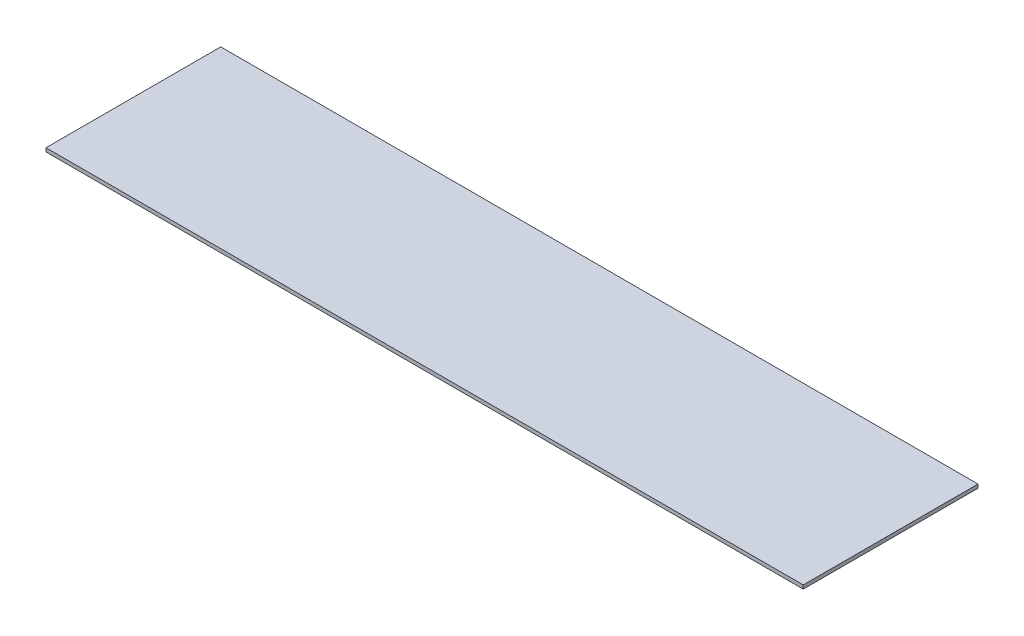
ISO-10303-21;
HEADER;
FILE_DESCRIPTION(('STEP AP214'),'2;1');
FILE_NAME('part.step','',(''),(''),'','','');
FILE_SCHEMA(('AUTOMOTIVE_DESIGN { 1 0 10303 214 1 1 1 1 }'));
ENDSEC;
DATA;
#1=APPLICATION_CONTEXT('core data for automotive mechanical design processes');
#2=APPLICATION_PROTOCOL_DEFINITION('international standard','automotive_design',2000,#1);
#3=PRODUCT_CONTEXT('',#1,'mechanical');
#4=PRODUCT('Part','Part','',(#3));
#5=PRODUCT_RELATED_PRODUCT_CATEGORY('part','',(#4));
#6=PRODUCT_DEFINITION_FORMATION('','',#4);
#7=PRODUCT_DEFINITION_CONTEXT('part definition',#1,'design');
#8=PRODUCT_DEFINITION('design','',#6,#7);
#9=PRODUCT_DEFINITION_SHAPE('','',#8);
#10=(LENGTH_UNIT() NAMED_UNIT(*) SI_UNIT(.MILLI.,.METRE.));
#11=(NAMED_UNIT(*) PLANE_ANGLE_UNIT() SI_UNIT($,.RADIAN.));
#12=(NAMED_UNIT(*) SI_UNIT($,.STERADIAN.) SOLID_ANGLE_UNIT());
#13=UNCERTAINTY_MEASURE_WITH_UNIT(LENGTH_MEASURE(1.E-05),#10,'distance_accuracy_value','');
#14=(GEOMETRIC_REPRESENTATION_CONTEXT(3) GLOBAL_UNCERTAINTY_ASSIGNED_CONTEXT((#13)) GLOBAL_UNIT_ASSIGNED_CONTEXT((#10,
#11,#12)) REPRESENTATION_CONTEXT('',''));
#15=CARTESIAN_POINT('',(0.,0.,0.));
#16=DIRECTION('',(0.,0.,1.));
#17=DIRECTION('',(1.,0.,0.));
#18=AXIS2_PLACEMENT_3D('',#15,#16,#17);
#19=CARTESIAN_POINT('',(208.,2.,-48.));
#20=DIRECTION('',(-1.,0.,0.));
#21=DIRECTION('',(0.,0.,1.));
#22=AXIS2_PLACEMENT_3D('',#19,#20,#21);
#23=PLANE('',#22);
#24=DIRECTION('',(0.,0.,-1.));
#25=VECTOR('',#24,1.);
#26=CARTESIAN_POINT('',(208.,0.,-48.));
#27=LINE('',#26,#25);
#28=CARTESIAN_POINT('',(208.,0.,48.));
#29=VERTEX_POINT('',#28);
#30=CARTESIAN_POINT('',(208.,0.,-48.));
#31=VERTEX_POINT('',#30);
#32=EDGE_CURVE('E107',#29,#31,#27,.T.);
#33=ORIENTED_EDGE('',*,*,#32,.T.);
#34=DIRECTION('',(0.,-1.,0.));
#35=VECTOR('',#34,1.);
#36=CARTESIAN_POINT('',(208.,2.,-48.));
#37=LINE('',#36,#35);
#38=CARTESIAN_POINT('',(208.,2.,-48.));
#39=VERTEX_POINT('',#38);
#40=EDGE_CURVE('E11',#39,#31,#37,.T.);
#41=ORIENTED_EDGE('',*,*,#40,.F.);
#42=DIRECTION('',(0.,0.,-1.));
#43=VECTOR('',#42,1.);
#44=CARTESIAN_POINT('',(208.,2.,-48.));
#45=LINE('',#44,#43);
#46=CARTESIAN_POINT('',(208.,2.,48.));
#47=VERTEX_POINT('',#46);
#48=EDGE_CURVE('E91',#47,#39,#45,.T.);
#49=ORIENTED_EDGE('',*,*,#48,.F.);
#50=DIRECTION('',(0.,-1.,0.));
#51=VECTOR('',#50,1.);
#52=CARTESIAN_POINT('',(208.,2.,48.));
#53=LINE('',#52,#51);
#54=EDGE_CURVE('E103',#47,#29,#53,.T.);
#55=ORIENTED_EDGE('',*,*,#54,.T.);
#56=EDGE_LOOP('',(#33,#41,#49,#55));
#57=FACE_BOUND('',#56,.T.);
#58=ADVANCED_FACE('F39',(#57),#23,.F.);
#59=CARTESIAN_POINT('',(-208.,2.,-48.));
#60=DIRECTION('',(0.,0.,1.));
#61=DIRECTION('',(1.,0.,0.));
#62=AXIS2_PLACEMENT_3D('',#59,#60,#61);
#63=PLANE('',#62);
#64=DIRECTION('',(-1.,0.,0.));
#65=VECTOR('',#64,1.);
#66=CARTESIAN_POINT('',(-208.,0.,-48.));
#67=LINE('',#66,#65);
#68=CARTESIAN_POINT('',(-208.,0.,-48.));
#69=VERTEX_POINT('',#68);
#70=EDGE_CURVE('E96',#31,#69,#67,.T.);
#71=ORIENTED_EDGE('',*,*,#70,.T.);
#72=DIRECTION('',(0.,-1.,0.));
#73=VECTOR('',#72,1.);
#74=CARTESIAN_POINT('',(-208.,2.,-48.));
#75=LINE('',#74,#73);
#76=CARTESIAN_POINT('',(-208.,2.,-48.));
#77=VERTEX_POINT('',#76);
#78=EDGE_CURVE('E48',#77,#69,#75,.T.);
#79=ORIENTED_EDGE('',*,*,#78,.F.);
#80=DIRECTION('',(-1.,0.,0.));
#81=VECTOR('',#80,1.);
#82=CARTESIAN_POINT('',(-208.,2.,-48.));
#83=LINE('',#82,#81);
#84=EDGE_CURVE('E86',#39,#77,#83,.T.);
#85=ORIENTED_EDGE('',*,*,#84,.F.);
#86=ORIENTED_EDGE('',*,*,#40,.T.);
#87=EDGE_LOOP('',(#71,#79,#85,#86));
#88=FACE_BOUND('',#87,.T.);
#89=ADVANCED_FACE('F95',(#88),#63,.F.);
#90=CARTESIAN_POINT('',(-208.,2.,-48.));
#91=DIRECTION('',(1.,0.,0.));
#92=DIRECTION('',(0.,0.,-1.));
#93=AXIS2_PLACEMENT_3D('',#90,#91,#92);
#94=PLANE('',#93);
#95=DIRECTION('',(0.,0.,1.));
#96=VECTOR('',#95,1.);
#97=CARTESIAN_POINT('',(-208.,0.,-48.));
#98=LINE('',#97,#96);
#99=CARTESIAN_POINT('',(-208.,0.,48.));
#100=VERTEX_POINT('',#99);
#101=EDGE_CURVE('E73',#69,#100,#98,.T.);
#102=ORIENTED_EDGE('',*,*,#101,.T.);
#103=DIRECTION('',(0.,-1.,0.));
#104=VECTOR('',#103,1.);
#105=CARTESIAN_POINT('',(-208.,2.,48.));
#106=LINE('',#105,#104);
#107=CARTESIAN_POINT('',(-208.,2.,48.));
#108=VERTEX_POINT('',#107);
#109=EDGE_CURVE('E98',#108,#100,#106,.T.);
#110=ORIENTED_EDGE('',*,*,#109,.F.);
#111=DIRECTION('',(0.,0.,1.));
#112=VECTOR('',#111,1.);
#113=CARTESIAN_POINT('',(-208.,2.,-48.));
#114=LINE('',#113,#112);
#115=EDGE_CURVE('E89',#77,#108,#114,.T.);
#116=ORIENTED_EDGE('',*,*,#115,.F.);
#117=ORIENTED_EDGE('',*,*,#78,.T.);
#118=EDGE_LOOP('',(#102,#110,#116,#117));
#119=FACE_BOUND('',#118,.T.);
#120=ADVANCED_FACE('F99',(#119),#94,.F.);
#121=CARTESIAN_POINT('',(-208.,2.,48.));
#122=DIRECTION('',(0.,0.,-1.));
#123=DIRECTION('',(-1.,0.,0.));
#124=AXIS2_PLACEMENT_3D('',#121,#122,#123);
#125=PLANE('',#124);
#126=DIRECTION('',(1.,0.,0.));
#127=VECTOR('',#126,1.);
#128=CARTESIAN_POINT('',(-208.,0.,48.));
#129=LINE('',#128,#127);
#130=EDGE_CURVE('E79',#100,#29,#129,.T.);
#131=ORIENTED_EDGE('',*,*,#130,.T.);
#132=ORIENTED_EDGE('',*,*,#54,.F.);
#133=DIRECTION('',(1.,0.,0.));
#134=VECTOR('',#133,1.);
#135=CARTESIAN_POINT('',(-208.,2.,48.));
#136=LINE('',#135,#134);
#137=EDGE_CURVE('E56',#108,#47,#136,.T.);
#138=ORIENTED_EDGE('',*,*,#137,.F.);
#139=ORIENTED_EDGE('',*,*,#109,.T.);
#140=EDGE_LOOP('',(#131,#132,#138,#139));
#141=FACE_BOUND('',#140,.T.);
#142=ADVANCED_FACE('F120',(#141),#125,.F.);
#143=CARTESIAN_POINT('',(0.,2.,0.));
#144=DIRECTION('',(0.,1.,0.));
#145=DIRECTION('',(0.,0.,1.));
#146=AXIS2_PLACEMENT_3D('',#143,#144,#145);
#147=PLANE('',#146);
#148=ORIENTED_EDGE('',*,*,#48,.T.);
#149=ORIENTED_EDGE('',*,*,#84,.T.);
#150=ORIENTED_EDGE('',*,*,#115,.T.);
#151=ORIENTED_EDGE('',*,*,#137,.T.);
#152=EDGE_LOOP('',(#148,#149,#150,#151));
#153=FACE_BOUND('',#152,.T.);
#154=ADVANCED_FACE('F87',(#153),#147,.T.);
#155=CARTESIAN_POINT('',(0.,0.,0.));
#156=DIRECTION('',(0.,1.,0.));
#157=DIRECTION('',(0.,0.,1.));
#158=AXIS2_PLACEMENT_3D('',#155,#156,#157);
#159=PLANE('',#158);
#160=ORIENTED_EDGE('',*,*,#32,.F.);
#161=ORIENTED_EDGE('',*,*,#130,.F.);
#162=ORIENTED_EDGE('',*,*,#101,.F.);
#163=ORIENTED_EDGE('',*,*,#70,.F.);
#164=EDGE_LOOP('',(#160,#161,#162,#163));
#165=FACE_BOUND('',#164,.T.);
#166=ADVANCED_FACE('F123',(#165),#159,.F.);
#167=CLOSED_SHELL('',(#58,#89,#120,#142,#154,#166));
#168=MANIFOLD_SOLID_BREP('B2',#167);
#169=ADVANCED_BREP_SHAPE_REPRESENTATION('',(#18,#168),#14);
#170=SHAPE_DEFINITION_REPRESENTATION(#9,#169);
ENDSEC;
END-ISO-10303-21;
